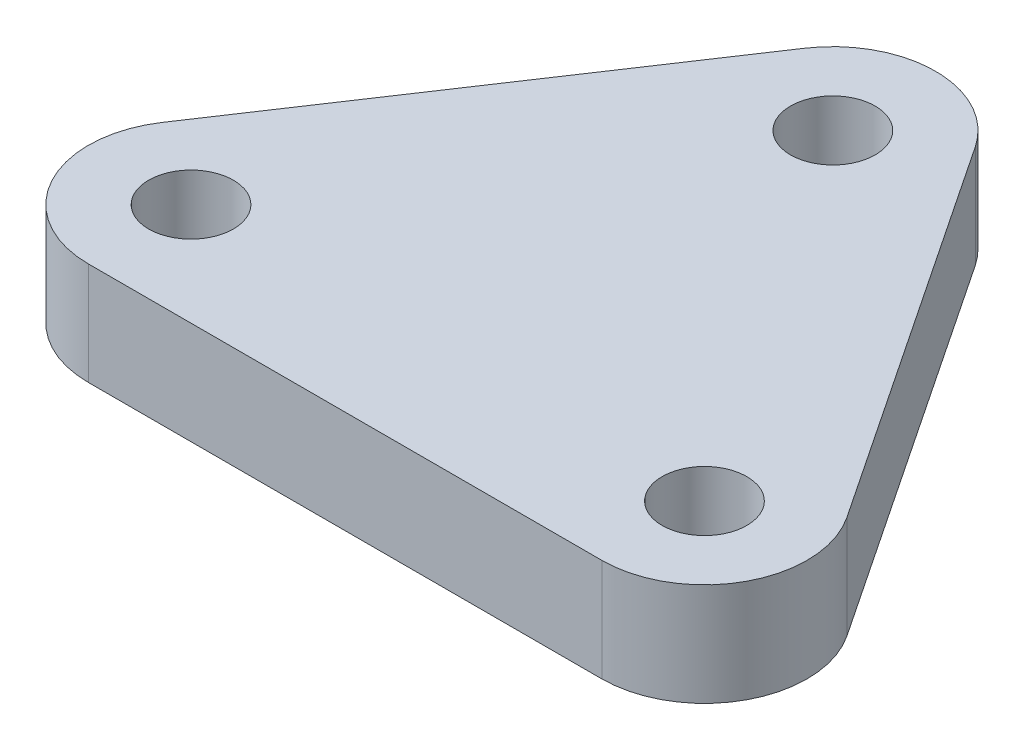
ISO-10303-21;
HEADER;
FILE_DESCRIPTION(('STEP AP214'),'2;1');
FILE_NAME('part.step','',(''),(''),'','','');
FILE_SCHEMA(('AUTOMOTIVE_DESIGN { 1 0 10303 214 1 1 1 1 }'));
ENDSEC;
DATA;
#1=APPLICATION_CONTEXT('core data for automotive mechanical design processes');
#2=APPLICATION_PROTOCOL_DEFINITION('international standard','automotive_design',2000,#1);
#3=PRODUCT_CONTEXT('',#1,'mechanical');
#4=PRODUCT('Part','Part','',(#3));
#5=PRODUCT_RELATED_PRODUCT_CATEGORY('part','',(#4));
#6=PRODUCT_DEFINITION_FORMATION('','',#4);
#7=PRODUCT_DEFINITION_CONTEXT('part definition',#1,'design');
#8=PRODUCT_DEFINITION('design','',#6,#7);
#9=PRODUCT_DEFINITION_SHAPE('','',#8);
#10=(LENGTH_UNIT() NAMED_UNIT(*) SI_UNIT(.MILLI.,.METRE.));
#11=(NAMED_UNIT(*) PLANE_ANGLE_UNIT() SI_UNIT($,.RADIAN.));
#12=(NAMED_UNIT(*) SI_UNIT($,.STERADIAN.) SOLID_ANGLE_UNIT());
#13=UNCERTAINTY_MEASURE_WITH_UNIT(LENGTH_MEASURE(1.E-05),#10,'distance_accuracy_value','');
#14=(GEOMETRIC_REPRESENTATION_CONTEXT(3) GLOBAL_UNCERTAINTY_ASSIGNED_CONTEXT((#13)) GLOBAL_UNIT_ASSIGNED_CONTEXT((#10,
#11,#12)) REPRESENTATION_CONTEXT('',''));
#15=CARTESIAN_POINT('',(0.,0.,0.));
#16=DIRECTION('',(0.,0.,1.));
#17=DIRECTION('',(1.,0.,0.));
#18=AXIS2_PLACEMENT_3D('',#15,#16,#17);
#19=CARTESIAN_POINT('',(10.,4.,0.));
#20=DIRECTION('',(0.,-1.,0.));
#21=DIRECTION('',(0.,0.,-1.));
#22=AXIS2_PLACEMENT_3D('',#19,#20,#21);
#23=CYLINDRICAL_SURFACE('',#22,4.);
#24=CARTESIAN_POINT('',(10.,0.,0.));
#25=DIRECTION('',(0.,1.,0.));
#26=DIRECTION('',(0.,0.,1.));
#27=AXIS2_PLACEMENT_3D('',#24,#25,#26);
#28=CIRCLE('',#27,4.);
#29=CARTESIAN_POINT('',(10.,0.,4.));
#30=VERTEX_POINT('',#29);
#31=CARTESIAN_POINT('',(13.3282011773514,0.,-2.21880078490091));
#32=VERTEX_POINT('',#31);
#33=EDGE_CURVE('E122',#30,#32,#28,.T.);
#34=ORIENTED_EDGE('',*,*,#33,.T.);
#35=DIRECTION('',(0.,-1.,0.));
#36=VECTOR('',#35,1.);
#37=CARTESIAN_POINT('',(13.3282011773514,4.,-2.21880078490091));
#38=LINE('',#37,#36);
#39=CARTESIAN_POINT('',(13.3282011773514,4.,-2.21880078490091));
#40=VERTEX_POINT('',#39);
#41=EDGE_CURVE('E11',#40,#32,#38,.T.);
#42=ORIENTED_EDGE('',*,*,#41,.F.);
#43=CARTESIAN_POINT('',(10.,4.,0.));
#44=DIRECTION('',(0.,1.,0.));
#45=DIRECTION('',(0.,0.,1.));
#46=AXIS2_PLACEMENT_3D('',#43,#44,#45);
#47=CIRCLE('',#46,4.);
#48=CARTESIAN_POINT('',(10.,4.,4.));
#49=VERTEX_POINT('',#48);
#50=EDGE_CURVE('E133',#49,#40,#47,.T.);
#51=ORIENTED_EDGE('',*,*,#50,.F.);
#52=DIRECTION('',(0.,-1.,0.));
#53=VECTOR('',#52,1.);
#54=CARTESIAN_POINT('',(10.,4.,4.));
#55=LINE('',#54,#53);
#56=EDGE_CURVE('E118',#49,#30,#55,.T.);
#57=ORIENTED_EDGE('',*,*,#56,.T.);
#58=EDGE_LOOP('',(#34,#42,#51,#57));
#59=FACE_BOUND('',#58,.T.);
#60=ADVANCED_FACE('F38',(#59),#23,.T.);
#61=CARTESIAN_POINT('',(13.3282011773514,4.,-2.21880078490091));
#62=DIRECTION('',(-0.832050294337844,0.,0.554700196225229));
#63=DIRECTION('',(0.554700196225229,0.,0.832050294337844));
#64=AXIS2_PLACEMENT_3D('',#61,#62,#63);
#65=PLANE('',#64);
#66=DIRECTION('',(-0.554700196225229,0.,-0.832050294337844));
#67=VECTOR('',#66,1.);
#68=CARTESIAN_POINT('',(13.3282011773514,0.,-2.21880078490091));
#69=LINE('',#68,#67);
#70=CARTESIAN_POINT('',(3.32820117735138,0.,-17.2188007849009));
#71=VERTEX_POINT('',#70);
#72=EDGE_CURVE('E125',#32,#71,#69,.T.);
#73=ORIENTED_EDGE('',*,*,#72,.T.);
#74=DIRECTION('',(0.,-1.,0.));
#75=VECTOR('',#74,1.);
#76=CARTESIAN_POINT('',(3.32820117735138,4.,-17.2188007849009));
#77=LINE('',#76,#75);
#78=CARTESIAN_POINT('',(3.32820117735138,4.,-17.2188007849009));
#79=VERTEX_POINT('',#78);
#80=EDGE_CURVE('E46',#79,#71,#77,.T.);
#81=ORIENTED_EDGE('',*,*,#80,.F.);
#82=DIRECTION('',(-0.554700196225229,0.,-0.832050294337844));
#83=VECTOR('',#82,1.);
#84=CARTESIAN_POINT('',(13.3282011773514,4.,-2.21880078490091));
#85=LINE('',#84,#83);
#86=EDGE_CURVE('E91',#40,#79,#85,.T.);
#87=ORIENTED_EDGE('',*,*,#86,.F.);
#88=ORIENTED_EDGE('',*,*,#41,.T.);
#89=EDGE_LOOP('',(#73,#81,#87,#88));
#90=FACE_BOUND('',#89,.T.);
#91=ADVANCED_FACE('F158',(#90),#65,.F.);
#92=CARTESIAN_POINT('',(0.,4.,-15.));
#93=DIRECTION('',(0.,-1.,0.));
#94=DIRECTION('',(0.,0.,-1.));
#95=AXIS2_PLACEMENT_3D('',#92,#93,#94);
#96=CYLINDRICAL_SURFACE('',#95,4.);
#97=CARTESIAN_POINT('',(0.,0.,-15.));
#98=DIRECTION('',(0.,1.,0.));
#99=DIRECTION('',(0.,0.,-1.));
#100=AXIS2_PLACEMENT_3D('',#97,#98,#99);
#101=CIRCLE('',#100,4.);
#102=CARTESIAN_POINT('',(-3.32820117735138,0.,-17.2188007849009));
#103=VERTEX_POINT('',#102);
#104=EDGE_CURVE('E128',#71,#103,#101,.T.);
#105=ORIENTED_EDGE('',*,*,#104,.T.);
#106=DIRECTION('',(0.,-1.,0.));
#107=VECTOR('',#106,1.);
#108=CARTESIAN_POINT('',(-3.32820117735138,4.,-17.2188007849009));
#109=LINE('',#108,#107);
#110=CARTESIAN_POINT('',(-3.32820117735138,4.,-17.2188007849009));
#111=VERTEX_POINT('',#110);
#112=EDGE_CURVE('E113',#111,#103,#109,.T.);
#113=ORIENTED_EDGE('',*,*,#112,.F.);
#114=CARTESIAN_POINT('',(0.,4.,-15.));
#115=DIRECTION('',(0.,1.,0.));
#116=DIRECTION('',(0.,0.,-1.));
#117=AXIS2_PLACEMENT_3D('',#114,#115,#116);
#118=CIRCLE('',#117,4.);
#119=EDGE_CURVE('E104',#79,#111,#118,.T.);
#120=ORIENTED_EDGE('',*,*,#119,.F.);
#121=ORIENTED_EDGE('',*,*,#80,.T.);
#122=EDGE_LOOP('',(#105,#113,#120,#121));
#123=FACE_BOUND('',#122,.T.);
#124=ADVANCED_FACE('F139',(#123),#96,.T.);
#125=CARTESIAN_POINT('',(-3.32820117735138,4.,-17.2188007849009));
#126=DIRECTION('',(0.832050294337844,0.,0.554700196225229));
#127=DIRECTION('',(0.554700196225229,0.,-0.832050294337844));
#128=AXIS2_PLACEMENT_3D('',#125,#126,#127);
#129=PLANE('',#128);
#130=DIRECTION('',(-0.554700196225229,0.,0.832050294337844));
#131=VECTOR('',#130,1.);
#132=CARTESIAN_POINT('',(-3.32820117735138,0.,-17.2188007849009));
#133=LINE('',#132,#131);
#134=CARTESIAN_POINT('',(-13.3282011773514,0.,-2.21880078490091));
#135=VERTEX_POINT('',#134);
#136=EDGE_CURVE('E112',#103,#135,#133,.T.);
#137=ORIENTED_EDGE('',*,*,#136,.T.);
#138=DIRECTION('',(0.,-1.,0.));
#139=VECTOR('',#138,1.);
#140=CARTESIAN_POINT('',(-13.3282011773514,4.,-2.21880078490091));
#141=LINE('',#140,#139);
#142=CARTESIAN_POINT('',(-13.3282011773514,4.,-2.21880078490091));
#143=VERTEX_POINT('',#142);
#144=EDGE_CURVE('E109',#143,#135,#141,.T.);
#145=ORIENTED_EDGE('',*,*,#144,.F.);
#146=DIRECTION('',(-0.554700196225229,0.,0.832050294337844));
#147=VECTOR('',#146,1.);
#148=CARTESIAN_POINT('',(-3.32820117735138,4.,-17.2188007849009));
#149=LINE('',#148,#147);
#150=EDGE_CURVE('E98',#111,#143,#149,.T.);
#151=ORIENTED_EDGE('',*,*,#150,.F.);
#152=ORIENTED_EDGE('',*,*,#112,.T.);
#153=EDGE_LOOP('',(#137,#145,#151,#152));
#154=FACE_BOUND('',#153,.T.);
#155=ADVANCED_FACE('F110',(#154),#129,.F.);
#156=CARTESIAN_POINT('',(-10.,4.,0.));
#157=DIRECTION('',(0.,-1.,0.));
#158=DIRECTION('',(0.,0.,-1.));
#159=AXIS2_PLACEMENT_3D('',#156,#157,#158);
#160=CYLINDRICAL_SURFACE('',#159,4.);
#161=CARTESIAN_POINT('',(-10.,0.,0.));
#162=DIRECTION('',(0.,1.,0.));
#163=DIRECTION('',(0.,0.,1.));
#164=AXIS2_PLACEMENT_3D('',#161,#162,#163);
#165=CIRCLE('',#164,4.);
#166=CARTESIAN_POINT('',(-10.,0.,4.));
#167=VERTEX_POINT('',#166);
#168=EDGE_CURVE('E77',#135,#167,#165,.T.);
#169=ORIENTED_EDGE('',*,*,#168,.T.);
#170=DIRECTION('',(0.,-1.,0.));
#171=VECTOR('',#170,1.);
#172=CARTESIAN_POINT('',(-10.,4.,4.));
#173=LINE('',#172,#171);
#174=CARTESIAN_POINT('',(-10.,4.,4.));
#175=VERTEX_POINT('',#174);
#176=EDGE_CURVE('E114',#175,#167,#173,.T.);
#177=ORIENTED_EDGE('',*,*,#176,.F.);
#178=CARTESIAN_POINT('',(-10.,4.,0.));
#179=DIRECTION('',(0.,1.,0.));
#180=DIRECTION('',(0.,0.,1.));
#181=AXIS2_PLACEMENT_3D('',#178,#179,#180);
#182=CIRCLE('',#181,4.);
#183=EDGE_CURVE('E102',#143,#175,#182,.T.);
#184=ORIENTED_EDGE('',*,*,#183,.F.);
#185=ORIENTED_EDGE('',*,*,#144,.T.);
#186=EDGE_LOOP('',(#169,#177,#184,#185));
#187=FACE_BOUND('',#186,.T.);
#188=ADVANCED_FACE('F116',(#187),#160,.T.);
#189=CARTESIAN_POINT('',(-10.,4.,4.));
#190=DIRECTION('',(0.,0.,-1.));
#191=DIRECTION('',(-1.,0.,0.));
#192=AXIS2_PLACEMENT_3D('',#189,#190,#191);
#193=PLANE('',#192);
#194=DIRECTION('',(1.,0.,0.));
#195=VECTOR('',#194,1.);
#196=CARTESIAN_POINT('',(-10.,0.,4.));
#197=LINE('',#196,#195);
#198=EDGE_CURVE('E83',#167,#30,#197,.T.);
#199=ORIENTED_EDGE('',*,*,#198,.T.);
#200=ORIENTED_EDGE('',*,*,#56,.F.);
#201=DIRECTION('',(1.,0.,0.));
#202=VECTOR('',#201,1.);
#203=CARTESIAN_POINT('',(-10.,4.,4.));
#204=LINE('',#203,#202);
#205=EDGE_CURVE('E54',#175,#49,#204,.T.);
#206=ORIENTED_EDGE('',*,*,#205,.F.);
#207=ORIENTED_EDGE('',*,*,#176,.T.);
#208=EDGE_LOOP('',(#199,#200,#206,#207));
#209=FACE_BOUND('',#208,.T.);
#210=ADVANCED_FACE('F146',(#209),#193,.F.);
#211=CARTESIAN_POINT('',(10.,4.,0.));
#212=DIRECTION('',(0.,1.,0.));
#213=DIRECTION('',(0.,0.,1.));
#214=AXIS2_PLACEMENT_3D('',#211,#212,#213);
#215=PLANE('',#214);
#216=CARTESIAN_POINT('',(0.,4.,-15.));
#217=DIRECTION('',(0.,1.,0.));
#218=DIRECTION('',(0.,0.,1.));
#219=AXIS2_PLACEMENT_3D('',#216,#217,#218);
#220=CIRCLE('',#219,1.65);
#221=CARTESIAN_POINT('',(0.,4.,-13.35));
#222=VERTEX_POINT('',#221);
#223=EDGE_CURVE('E252',#222,#222,#220,.T.);
#224=ORIENTED_EDGE('',*,*,#223,.F.);
#225=EDGE_LOOP('',(#224));
#226=FACE_BOUND('',#225,.T.);
#227=CARTESIAN_POINT('',(-10.,4.,0.));
#228=DIRECTION('',(0.,1.,0.));
#229=DIRECTION('',(0.,0.,1.));
#230=AXIS2_PLACEMENT_3D('',#227,#228,#229);
#231=CIRCLE('',#230,1.65);
#232=CARTESIAN_POINT('',(-10.,4.,1.65));
#233=VERTEX_POINT('',#232);
#234=EDGE_CURVE('E254',#233,#233,#231,.T.);
#235=ORIENTED_EDGE('',*,*,#234,.F.);
#236=EDGE_LOOP('',(#235));
#237=FACE_BOUND('',#236,.T.);
#238=CARTESIAN_POINT('',(10.,4.,0.));
#239=DIRECTION('',(0.,1.,0.));
#240=DIRECTION('',(0.,0.,1.));
#241=AXIS2_PLACEMENT_3D('',#238,#239,#240);
#242=CIRCLE('',#241,1.65);
#243=CARTESIAN_POINT('',(10.,4.,1.65));
#244=VERTEX_POINT('',#243);
#245=EDGE_CURVE('E262',#244,#244,#242,.T.);
#246=ORIENTED_EDGE('',*,*,#245,.F.);
#247=EDGE_LOOP('',(#246));
#248=FACE_BOUND('',#247,.T.);
#249=ORIENTED_EDGE('',*,*,#50,.T.);
#250=ORIENTED_EDGE('',*,*,#86,.T.);
#251=ORIENTED_EDGE('',*,*,#119,.T.);
#252=ORIENTED_EDGE('',*,*,#150,.T.);
#253=ORIENTED_EDGE('',*,*,#183,.T.);
#254=ORIENTED_EDGE('',*,*,#205,.T.);
#255=EDGE_LOOP('',(#249,#250,#251,#252,#253,#254));
#256=FACE_BOUND('',#255,.T.);
#257=ADVANCED_FACE('F100',(#226,#237,#248,#256),#215,.T.);
#258=CARTESIAN_POINT('',(10.,0.,0.));
#259=DIRECTION('',(0.,1.,0.));
#260=DIRECTION('',(0.,0.,1.));
#261=AXIS2_PLACEMENT_3D('',#258,#259,#260);
#262=PLANE('',#261);
#263=CARTESIAN_POINT('',(0.,0.,-15.));
#264=DIRECTION('',(0.,1.,0.));
#265=DIRECTION('',(0.,0.,1.));
#266=AXIS2_PLACEMENT_3D('',#263,#264,#265);
#267=CIRCLE('',#266,1.65);
#268=CARTESIAN_POINT('',(0.,0.,-13.35));
#269=VERTEX_POINT('',#268);
#270=EDGE_CURVE('E249',#269,#269,#267,.T.);
#271=ORIENTED_EDGE('',*,*,#270,.T.);
#272=EDGE_LOOP('',(#271));
#273=FACE_BOUND('',#272,.T.);
#274=CARTESIAN_POINT('',(-10.,0.,0.));
#275=DIRECTION('',(0.,1.,0.));
#276=DIRECTION('',(0.,0.,1.));
#277=AXIS2_PLACEMENT_3D('',#274,#275,#276);
#278=CIRCLE('',#277,1.65);
#279=CARTESIAN_POINT('',(-10.,0.,1.65));
#280=VERTEX_POINT('',#279);
#281=EDGE_CURVE('E259',#280,#280,#278,.T.);
#282=ORIENTED_EDGE('',*,*,#281,.T.);
#283=EDGE_LOOP('',(#282));
#284=FACE_BOUND('',#283,.T.);
#285=CARTESIAN_POINT('',(10.,0.,0.));
#286=DIRECTION('',(0.,1.,0.));
#287=DIRECTION('',(0.,0.,1.));
#288=AXIS2_PLACEMENT_3D('',#285,#286,#287);
#289=CIRCLE('',#288,1.65);
#290=CARTESIAN_POINT('',(10.,0.,1.65));
#291=VERTEX_POINT('',#290);
#292=EDGE_CURVE('E126',#291,#291,#289,.T.);
#293=ORIENTED_EDGE('',*,*,#292,.T.);
#294=EDGE_LOOP('',(#293));
#295=FACE_BOUND('',#294,.T.);
#296=ORIENTED_EDGE('',*,*,#33,.F.);
#297=ORIENTED_EDGE('',*,*,#198,.F.);
#298=ORIENTED_EDGE('',*,*,#168,.F.);
#299=ORIENTED_EDGE('',*,*,#136,.F.);
#300=ORIENTED_EDGE('',*,*,#104,.F.);
#301=ORIENTED_EDGE('',*,*,#72,.F.);
#302=EDGE_LOOP('',(#296,#297,#298,#299,#300,#301));
#303=FACE_BOUND('',#302,.T.);
#304=ADVANCED_FACE('F142',(#273,#284,#295,#303),#262,.F.);
#305=CARTESIAN_POINT('',(10.,4.,0.));
#306=DIRECTION('',(0.,1.,0.));
#307=DIRECTION('',(0.,0.,1.));
#308=AXIS2_PLACEMENT_3D('',#305,#306,#307);
#309=CYLINDRICAL_SURFACE('',#308,1.65);
#310=ORIENTED_EDGE('',*,*,#292,.F.);
#311=EDGE_LOOP('',(#310));
#312=FACE_BOUND('',#311,.T.);
#313=ORIENTED_EDGE('',*,*,#245,.T.);
#314=EDGE_LOOP('',(#313));
#315=FACE_BOUND('',#314,.T.);
#316=ADVANCED_FACE('F199',(#312,#315),#309,.F.);
#317=CARTESIAN_POINT('',(-10.,4.,0.));
#318=DIRECTION('',(0.,1.,0.));
#319=DIRECTION('',(0.,0.,1.));
#320=AXIS2_PLACEMENT_3D('',#317,#318,#319);
#321=CYLINDRICAL_SURFACE('',#320,1.65);
#322=ORIENTED_EDGE('',*,*,#281,.F.);
#323=EDGE_LOOP('',(#322));
#324=FACE_BOUND('',#323,.T.);
#325=ORIENTED_EDGE('',*,*,#234,.T.);
#326=EDGE_LOOP('',(#325));
#327=FACE_BOUND('',#326,.T.);
#328=ADVANCED_FACE('F209',(#324,#327),#321,.F.);
#329=CARTESIAN_POINT('',(0.,4.,-15.));
#330=DIRECTION('',(0.,1.,0.));
#331=DIRECTION('',(0.,0.,1.));
#332=AXIS2_PLACEMENT_3D('',#329,#330,#331);
#333=CYLINDRICAL_SURFACE('',#332,1.65);
#334=ORIENTED_EDGE('',*,*,#270,.F.);
#335=EDGE_LOOP('',(#334));
#336=FACE_BOUND('',#335,.T.);
#337=ORIENTED_EDGE('',*,*,#223,.T.);
#338=EDGE_LOOP('',(#337));
#339=FACE_BOUND('',#338,.T.);
#340=ADVANCED_FACE('F220',(#336,#339),#333,.F.);
#341=CLOSED_SHELL('',(#60,#91,#124,#155,#188,#210,#257,#304,#316,#328,#340));
#342=MANIFOLD_SOLID_BREP('B2',#341);
#343=ADVANCED_BREP_SHAPE_REPRESENTATION('',(#18,#342),#14);
#344=SHAPE_DEFINITION_REPRESENTATION(#9,#343);
ENDSEC;
END-ISO-10303-21;
